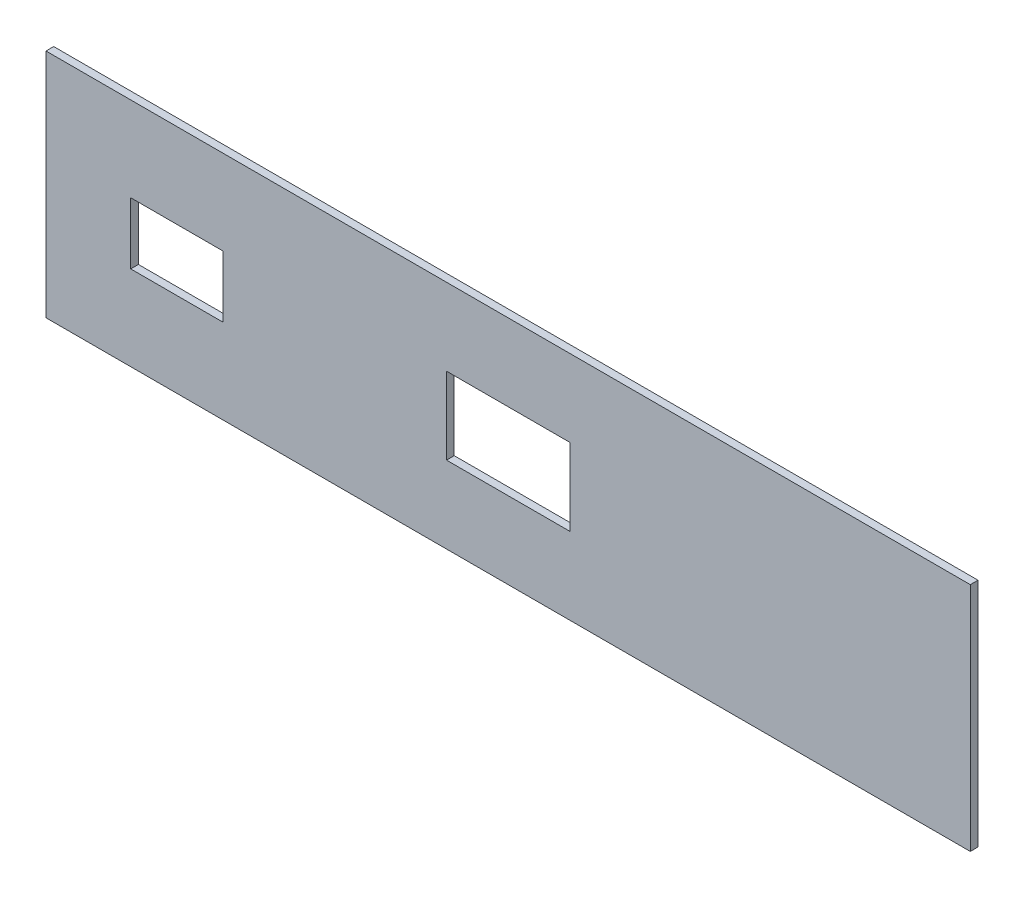
ISO-10303-21;
HEADER;
FILE_DESCRIPTION(('STEP AP214'),'2;1');
FILE_NAME('part.step','',(''),(''),'','','');
FILE_SCHEMA(('AUTOMOTIVE_DESIGN { 1 0 10303 214 1 1 1 1 }'));
ENDSEC;
DATA;
#1=APPLICATION_CONTEXT('core data for automotive mechanical design processes');
#2=APPLICATION_PROTOCOL_DEFINITION('international standard','automotive_design',2000,#1);
#3=PRODUCT_CONTEXT('',#1,'mechanical');
#4=PRODUCT('Part','Part','',(#3));
#5=PRODUCT_RELATED_PRODUCT_CATEGORY('part','',(#4));
#6=PRODUCT_DEFINITION_FORMATION('','',#4);
#7=PRODUCT_DEFINITION_CONTEXT('part definition',#1,'design');
#8=PRODUCT_DEFINITION('design','',#6,#7);
#9=PRODUCT_DEFINITION_SHAPE('','',#8);
#10=(LENGTH_UNIT() NAMED_UNIT(*) SI_UNIT(.MILLI.,.METRE.));
#11=(NAMED_UNIT(*) PLANE_ANGLE_UNIT() SI_UNIT($,.RADIAN.));
#12=(NAMED_UNIT(*) SI_UNIT($,.STERADIAN.) SOLID_ANGLE_UNIT());
#13=UNCERTAINTY_MEASURE_WITH_UNIT(LENGTH_MEASURE(1.E-05),#10,'distance_accuracy_value','');
#14=(GEOMETRIC_REPRESENTATION_CONTEXT(3) GLOBAL_UNCERTAINTY_ASSIGNED_CONTEXT((#13)) GLOBAL_UNIT_ASSIGNED_CONTEXT((#10,
#11,#12)) REPRESENTATION_CONTEXT('',''));
#15=CARTESIAN_POINT('',(0.,0.,0.));
#16=DIRECTION('',(0.,0.,1.));
#17=DIRECTION('',(1.,0.,0.));
#18=AXIS2_PLACEMENT_3D('',#15,#16,#17);
#19=CARTESIAN_POINT('',(0.,0.,5.));
#20=DIRECTION('',(0.,0.,1.));
#21=DIRECTION('',(1.,0.,0.));
#22=AXIS2_PLACEMENT_3D('',#19,#20,#21);
#23=PLANE('',#22);
#24=DIRECTION('',(0.,1.,0.));
#25=VECTOR('',#24,1.);
#26=CARTESIAN_POINT('',(300.,75.,5.));
#27=LINE('',#26,#25);
#28=CARTESIAN_POINT('',(300.,-75.,5.));
#29=VERTEX_POINT('',#28);
#30=CARTESIAN_POINT('',(300.,75.,5.));
#31=VERTEX_POINT('',#30);
#32=EDGE_CURVE('E189',#29,#31,#27,.T.);
#33=ORIENTED_EDGE('',*,*,#32,.T.);
#34=DIRECTION('',(-1.,0.,0.));
#35=VECTOR('',#34,1.);
#36=CARTESIAN_POINT('',(-300.,75.,5.));
#37=LINE('',#36,#35);
#38=CARTESIAN_POINT('',(-300.,75.,5.));
#39=VERTEX_POINT('',#38);
#40=EDGE_CURVE('E192',#31,#39,#37,.T.);
#41=ORIENTED_EDGE('',*,*,#40,.T.);
#42=DIRECTION('',(0.,-1.,0.));
#43=VECTOR('',#42,1.);
#44=CARTESIAN_POINT('',(-300.,75.,5.));
#45=LINE('',#44,#43);
#46=CARTESIAN_POINT('',(-300.,-75.,5.));
#47=VERTEX_POINT('',#46);
#48=EDGE_CURVE('E195',#39,#47,#45,.T.);
#49=ORIENTED_EDGE('',*,*,#48,.T.);
#50=DIRECTION('',(1.,0.,0.));
#51=VECTOR('',#50,1.);
#52=CARTESIAN_POINT('',(-300.,-75.,5.));
#53=LINE('',#52,#51);
#54=EDGE_CURVE('E197',#47,#29,#53,.T.);
#55=ORIENTED_EDGE('',*,*,#54,.T.);
#56=EDGE_LOOP('',(#33,#41,#49,#55));
#57=FACE_BOUND('',#56,.T.);
#58=DIRECTION('',(-1.,0.,0.));
#59=VECTOR('',#58,1.);
#60=CARTESIAN_POINT('',(-245.,20.0000000000001,5.));
#61=LINE('',#60,#59);
#62=CARTESIAN_POINT('',(-185.,20.0000000000001,5.));
#63=VERTEX_POINT('',#62);
#64=CARTESIAN_POINT('',(-245.,20.0000000000001,5.));
#65=VERTEX_POINT('',#64);
#66=EDGE_CURVE('E160',#63,#65,#61,.T.);
#67=ORIENTED_EDGE('',*,*,#66,.F.);
#68=DIRECTION('',(0.,1.,0.));
#69=VECTOR('',#68,1.);
#70=CARTESIAN_POINT('',(-185.,20.0000000000001,5.));
#71=LINE('',#70,#69);
#72=CARTESIAN_POINT('',(-185.,-19.9999999999999,5.));
#73=VERTEX_POINT('',#72);
#74=EDGE_CURVE('E158',#73,#63,#71,.T.);
#75=ORIENTED_EDGE('',*,*,#74,.F.);
#76=DIRECTION('',(1.,0.,0.));
#77=VECTOR('',#76,1.);
#78=CARTESIAN_POINT('',(-245.,-19.9999999999999,5.));
#79=LINE('',#78,#77);
#80=CARTESIAN_POINT('',(-245.,-19.9999999999999,5.));
#81=VERTEX_POINT('',#80);
#82=EDGE_CURVE('E166',#81,#73,#79,.T.);
#83=ORIENTED_EDGE('',*,*,#82,.F.);
#84=DIRECTION('',(0.,-1.,0.));
#85=VECTOR('',#84,1.);
#86=CARTESIAN_POINT('',(-245.,20.0000000000001,5.));
#87=LINE('',#86,#85);
#88=EDGE_CURVE('E163',#65,#81,#87,.T.);
#89=ORIENTED_EDGE('',*,*,#88,.F.);
#90=EDGE_LOOP('',(#67,#75,#83,#89));
#91=FACE_BOUND('',#90,.T.);
#92=DIRECTION('',(-1.,0.,0.));
#93=VECTOR('',#92,1.);
#94=CARTESIAN_POINT('',(-40.,25.0000000000001,5.));
#95=LINE('',#94,#93);
#96=CARTESIAN_POINT('',(40.,25.0000000000001,5.));
#97=VERTEX_POINT('',#96);
#98=CARTESIAN_POINT('',(-40.,25.0000000000001,5.));
#99=VERTEX_POINT('',#98);
#100=EDGE_CURVE('E130',#97,#99,#95,.T.);
#101=ORIENTED_EDGE('',*,*,#100,.F.);
#102=DIRECTION('',(0.,1.,0.));
#103=VECTOR('',#102,1.);
#104=CARTESIAN_POINT('',(40.,25.0000000000001,5.));
#105=LINE('',#104,#103);
#106=CARTESIAN_POINT('',(40.,-24.9999999999999,5.));
#107=VERTEX_POINT('',#106);
#108=EDGE_CURVE('E122',#107,#97,#105,.T.);
#109=ORIENTED_EDGE('',*,*,#108,.F.);
#110=DIRECTION('',(1.,0.,0.));
#111=VECTOR('',#110,1.);
#112=CARTESIAN_POINT('',(-40.,-24.9999999999999,5.));
#113=LINE('',#112,#111);
#114=CARTESIAN_POINT('',(-40.,-24.9999999999999,5.));
#115=VERTEX_POINT('',#114);
#116=EDGE_CURVE('E144',#115,#107,#113,.T.);
#117=ORIENTED_EDGE('',*,*,#116,.F.);
#118=DIRECTION('',(0.,-1.,0.));
#119=VECTOR('',#118,1.);
#120=CARTESIAN_POINT('',(-40.,25.0000000000001,5.));
#121=LINE('',#120,#119);
#122=EDGE_CURVE('E142',#99,#115,#121,.T.);
#123=ORIENTED_EDGE('',*,*,#122,.F.);
#124=EDGE_LOOP('',(#101,#109,#117,#123));
#125=FACE_BOUND('',#124,.T.);
#126=ADVANCED_FACE('F33',(#57,#91,#125),#23,.T.);
#127=CARTESIAN_POINT('',(0.,0.,0.));
#128=DIRECTION('',(0.,0.,1.));
#129=DIRECTION('',(1.,0.,0.));
#130=AXIS2_PLACEMENT_3D('',#127,#128,#129);
#131=PLANE('',#130);
#132=DIRECTION('',(0.,1.,0.));
#133=VECTOR('',#132,1.);
#134=CARTESIAN_POINT('',(-185.,20.0000000000001,0.));
#135=LINE('',#134,#133);
#136=CARTESIAN_POINT('',(-185.,-19.9999999999999,0.));
#137=VERTEX_POINT('',#136);
#138=CARTESIAN_POINT('',(-185.,20.0000000000001,0.));
#139=VERTEX_POINT('',#138);
#140=EDGE_CURVE('E138',#137,#139,#135,.T.);
#141=ORIENTED_EDGE('',*,*,#140,.T.);
#142=DIRECTION('',(-1.,0.,0.));
#143=VECTOR('',#142,1.);
#144=CARTESIAN_POINT('',(-245.,20.0000000000001,0.));
#145=LINE('',#144,#143);
#146=CARTESIAN_POINT('',(-245.,20.0000000000001,0.));
#147=VERTEX_POINT('',#146);
#148=EDGE_CURVE('E171',#139,#147,#145,.T.);
#149=ORIENTED_EDGE('',*,*,#148,.T.);
#150=DIRECTION('',(0.,-1.,0.));
#151=VECTOR('',#150,1.);
#152=CARTESIAN_POINT('',(-245.,20.0000000000001,0.));
#153=LINE('',#152,#151);
#154=CARTESIAN_POINT('',(-245.,-19.9999999999999,0.));
#155=VERTEX_POINT('',#154);
#156=EDGE_CURVE('E174',#147,#155,#153,.T.);
#157=ORIENTED_EDGE('',*,*,#156,.T.);
#158=DIRECTION('',(1.,0.,0.));
#159=VECTOR('',#158,1.);
#160=CARTESIAN_POINT('',(-245.,-19.9999999999999,0.));
#161=LINE('',#160,#159);
#162=EDGE_CURVE('E161',#155,#137,#161,.T.);
#163=ORIENTED_EDGE('',*,*,#162,.T.);
#164=EDGE_LOOP('',(#141,#149,#157,#163));
#165=FACE_BOUND('',#164,.T.);
#166=DIRECTION('',(0.,1.,0.));
#167=VECTOR('',#166,1.);
#168=CARTESIAN_POINT('',(300.,75.,0.));
#169=LINE('',#168,#167);
#170=CARTESIAN_POINT('',(300.,-75.,0.));
#171=VERTEX_POINT('',#170);
#172=CARTESIAN_POINT('',(300.,75.,0.));
#173=VERTEX_POINT('',#172);
#174=EDGE_CURVE('E188',#171,#173,#169,.T.);
#175=ORIENTED_EDGE('',*,*,#174,.F.);
#176=DIRECTION('',(1.,0.,0.));
#177=VECTOR('',#176,1.);
#178=CARTESIAN_POINT('',(-300.,-75.,0.));
#179=LINE('',#178,#177);
#180=CARTESIAN_POINT('',(-300.,-75.,0.));
#181=VERTEX_POINT('',#180);
#182=EDGE_CURVE('E193',#181,#171,#179,.T.);
#183=ORIENTED_EDGE('',*,*,#182,.F.);
#184=DIRECTION('',(0.,-1.,0.));
#185=VECTOR('',#184,1.);
#186=CARTESIAN_POINT('',(-300.,75.,0.));
#187=LINE('',#186,#185);
#188=CARTESIAN_POINT('',(-300.,75.,0.));
#189=VERTEX_POINT('',#188);
#190=EDGE_CURVE('E204',#189,#181,#187,.T.);
#191=ORIENTED_EDGE('',*,*,#190,.F.);
#192=DIRECTION('',(-1.,0.,0.));
#193=VECTOR('',#192,1.);
#194=CARTESIAN_POINT('',(-300.,75.,0.));
#195=LINE('',#194,#193);
#196=EDGE_CURVE('E202',#173,#189,#195,.T.);
#197=ORIENTED_EDGE('',*,*,#196,.F.);
#198=EDGE_LOOP('',(#175,#183,#191,#197));
#199=FACE_BOUND('',#198,.T.);
#200=DIRECTION('',(0.,1.,0.));
#201=VECTOR('',#200,1.);
#202=CARTESIAN_POINT('',(40.,25.0000000000001,0.));
#203=LINE('',#202,#201);
#204=CARTESIAN_POINT('',(40.,-24.9999999999999,0.));
#205=VERTEX_POINT('',#204);
#206=CARTESIAN_POINT('',(40.,25.0000000000001,0.));
#207=VERTEX_POINT('',#206);
#208=EDGE_CURVE('E56',#205,#207,#203,.T.);
#209=ORIENTED_EDGE('',*,*,#208,.T.);
#210=DIRECTION('',(-1.,0.,0.));
#211=VECTOR('',#210,1.);
#212=CARTESIAN_POINT('',(-40.,25.0000000000001,0.));
#213=LINE('',#212,#211);
#214=CARTESIAN_POINT('',(-40.,25.0000000000001,0.));
#215=VERTEX_POINT('',#214);
#216=EDGE_CURVE('E137',#207,#215,#213,.T.);
#217=ORIENTED_EDGE('',*,*,#216,.T.);
#218=DIRECTION('',(0.,-1.,0.));
#219=VECTOR('',#218,1.);
#220=CARTESIAN_POINT('',(-40.,25.0000000000001,0.));
#221=LINE('',#220,#219);
#222=CARTESIAN_POINT('',(-40.,-24.9999999999999,0.));
#223=VERTEX_POINT('',#222);
#224=EDGE_CURVE('E150',#215,#223,#221,.T.);
#225=ORIENTED_EDGE('',*,*,#224,.T.);
#226=DIRECTION('',(1.,0.,0.));
#227=VECTOR('',#226,1.);
#228=CARTESIAN_POINT('',(-40.,-24.9999999999999,0.));
#229=LINE('',#228,#227);
#230=EDGE_CURVE('E131',#223,#205,#229,.T.);
#231=ORIENTED_EDGE('',*,*,#230,.T.);
#232=EDGE_LOOP('',(#209,#217,#225,#231));
#233=FACE_BOUND('',#232,.T.);
#234=ADVANCED_FACE('F222',(#165,#199,#233),#131,.F.);
#235=CARTESIAN_POINT('',(300.,75.,5.));
#236=DIRECTION('',(-1.,0.,0.));
#237=DIRECTION('',(0.,0.,1.));
#238=AXIS2_PLACEMENT_3D('',#235,#236,#237);
#239=PLANE('',#238);
#240=ORIENTED_EDGE('',*,*,#174,.T.);
#241=DIRECTION('',(0.,0.,-1.));
#242=VECTOR('',#241,1.);
#243=CARTESIAN_POINT('',(300.,75.,5.));
#244=LINE('',#243,#242);
#245=EDGE_CURVE('E11',#31,#173,#244,.T.);
#246=ORIENTED_EDGE('',*,*,#245,.F.);
#247=ORIENTED_EDGE('',*,*,#32,.F.);
#248=DIRECTION('',(0.,0.,-1.));
#249=VECTOR('',#248,1.);
#250=CARTESIAN_POINT('',(300.,-75.,5.));
#251=LINE('',#250,#249);
#252=EDGE_CURVE('E199',#29,#171,#251,.T.);
#253=ORIENTED_EDGE('',*,*,#252,.T.);
#254=EDGE_LOOP('',(#240,#246,#247,#253));
#255=FACE_BOUND('',#254,.T.);
#256=ADVANCED_FACE('F35',(#255),#239,.F.);
#257=CARTESIAN_POINT('',(-300.,75.,5.));
#258=DIRECTION('',(0.,-1.,0.));
#259=DIRECTION('',(0.,0.,-1.));
#260=AXIS2_PLACEMENT_3D('',#257,#258,#259);
#261=PLANE('',#260);
#262=ORIENTED_EDGE('',*,*,#196,.T.);
#263=DIRECTION('',(0.,0.,-1.));
#264=VECTOR('',#263,1.);
#265=CARTESIAN_POINT('',(-300.,75.,5.));
#266=LINE('',#265,#264);
#267=EDGE_CURVE('E41',#39,#189,#266,.T.);
#268=ORIENTED_EDGE('',*,*,#267,.F.);
#269=ORIENTED_EDGE('',*,*,#40,.F.);
#270=ORIENTED_EDGE('',*,*,#245,.T.);
#271=EDGE_LOOP('',(#262,#268,#269,#270));
#272=FACE_BOUND('',#271,.T.);
#273=ADVANCED_FACE('F233',(#272),#261,.F.);
#274=CARTESIAN_POINT('',(-300.,75.,5.));
#275=DIRECTION('',(1.,0.,0.));
#276=DIRECTION('',(0.,0.,-1.));
#277=AXIS2_PLACEMENT_3D('',#274,#275,#276);
#278=PLANE('',#277);
#279=ORIENTED_EDGE('',*,*,#190,.T.);
#280=DIRECTION('',(0.,0.,-1.));
#281=VECTOR('',#280,1.);
#282=CARTESIAN_POINT('',(-300.,-75.,5.));
#283=LINE('',#282,#281);
#284=EDGE_CURVE('E209',#47,#181,#283,.T.);
#285=ORIENTED_EDGE('',*,*,#284,.F.);
#286=ORIENTED_EDGE('',*,*,#48,.F.);
#287=ORIENTED_EDGE('',*,*,#267,.T.);
#288=EDGE_LOOP('',(#279,#285,#286,#287));
#289=FACE_BOUND('',#288,.T.);
#290=ADVANCED_FACE('F216',(#289),#278,.F.);
#291=CARTESIAN_POINT('',(-300.,-75.,5.));
#292=DIRECTION('',(0.,1.,0.));
#293=DIRECTION('',(0.,0.,1.));
#294=AXIS2_PLACEMENT_3D('',#291,#292,#293);
#295=PLANE('',#294);
#296=ORIENTED_EDGE('',*,*,#182,.T.);
#297=ORIENTED_EDGE('',*,*,#252,.F.);
#298=ORIENTED_EDGE('',*,*,#54,.F.);
#299=ORIENTED_EDGE('',*,*,#284,.T.);
#300=EDGE_LOOP('',(#296,#297,#298,#299));
#301=FACE_BOUND('',#300,.T.);
#302=ADVANCED_FACE('F226',(#301),#295,.F.);
#303=CARTESIAN_POINT('',(-185.,20.0000000000001,5.));
#304=DIRECTION('',(-1.,0.,0.));
#305=DIRECTION('',(0.,0.,1.));
#306=AXIS2_PLACEMENT_3D('',#303,#304,#305);
#307=PLANE('',#306);
#308=ORIENTED_EDGE('',*,*,#140,.F.);
#309=DIRECTION('',(0.,0.,-1.));
#310=VECTOR('',#309,1.);
#311=CARTESIAN_POINT('',(-185.,-19.9999999999999,5.));
#312=LINE('',#311,#310);
#313=EDGE_CURVE('E168',#73,#137,#312,.T.);
#314=ORIENTED_EDGE('',*,*,#313,.F.);
#315=ORIENTED_EDGE('',*,*,#74,.T.);
#316=DIRECTION('',(0.,0.,-1.));
#317=VECTOR('',#316,1.);
#318=CARTESIAN_POINT('',(-185.,20.0000000000001,5.));
#319=LINE('',#318,#317);
#320=EDGE_CURVE('E185',#63,#139,#319,.T.);
#321=ORIENTED_EDGE('',*,*,#320,.T.);
#322=EDGE_LOOP('',(#308,#314,#315,#321));
#323=FACE_BOUND('',#322,.T.);
#324=ADVANCED_FACE('F248',(#323),#307,.T.);
#325=CARTESIAN_POINT('',(-245.,20.0000000000001,5.));
#326=DIRECTION('',(0.,-1.,0.));
#327=DIRECTION('',(0.,0.,-1.));
#328=AXIS2_PLACEMENT_3D('',#325,#326,#327);
#329=PLANE('',#328);
#330=ORIENTED_EDGE('',*,*,#148,.F.);
#331=ORIENTED_EDGE('',*,*,#320,.F.);
#332=ORIENTED_EDGE('',*,*,#66,.T.);
#333=DIRECTION('',(0.,0.,-1.));
#334=VECTOR('',#333,1.);
#335=CARTESIAN_POINT('',(-245.,20.0000000000001,5.));
#336=LINE('',#335,#334);
#337=EDGE_CURVE('E183',#65,#147,#336,.T.);
#338=ORIENTED_EDGE('',*,*,#337,.T.);
#339=EDGE_LOOP('',(#330,#331,#332,#338));
#340=FACE_BOUND('',#339,.T.);
#341=ADVANCED_FACE('F255',(#340),#329,.T.);
#342=CARTESIAN_POINT('',(-245.,20.0000000000001,5.));
#343=DIRECTION('',(1.,0.,0.));
#344=DIRECTION('',(0.,0.,-1.));
#345=AXIS2_PLACEMENT_3D('',#342,#343,#344);
#346=PLANE('',#345);
#347=ORIENTED_EDGE('',*,*,#156,.F.);
#348=ORIENTED_EDGE('',*,*,#337,.F.);
#349=ORIENTED_EDGE('',*,*,#88,.T.);
#350=DIRECTION('',(0.,0.,-1.));
#351=VECTOR('',#350,1.);
#352=CARTESIAN_POINT('',(-245.,-19.9999999999999,5.));
#353=LINE('',#352,#351);
#354=EDGE_CURVE('E181',#81,#155,#353,.T.);
#355=ORIENTED_EDGE('',*,*,#354,.T.);
#356=EDGE_LOOP('',(#347,#348,#349,#355));
#357=FACE_BOUND('',#356,.T.);
#358=ADVANCED_FACE('F260',(#357),#346,.T.);
#359=CARTESIAN_POINT('',(-245.,-19.9999999999999,5.));
#360=DIRECTION('',(0.,1.,0.));
#361=DIRECTION('',(0.,0.,1.));
#362=AXIS2_PLACEMENT_3D('',#359,#360,#361);
#363=PLANE('',#362);
#364=ORIENTED_EDGE('',*,*,#162,.F.);
#365=ORIENTED_EDGE('',*,*,#354,.F.);
#366=ORIENTED_EDGE('',*,*,#82,.T.);
#367=ORIENTED_EDGE('',*,*,#313,.T.);
#368=EDGE_LOOP('',(#364,#365,#366,#367));
#369=FACE_BOUND('',#368,.T.);
#370=ADVANCED_FACE('F267',(#369),#363,.T.);
#371=CARTESIAN_POINT('',(40.,25.0000000000001,5.));
#372=DIRECTION('',(-1.,0.,0.));
#373=DIRECTION('',(0.,0.,1.));
#374=AXIS2_PLACEMENT_3D('',#371,#372,#373);
#375=PLANE('',#374);
#376=ORIENTED_EDGE('',*,*,#208,.F.);
#377=DIRECTION('',(0.,0.,-1.));
#378=VECTOR('',#377,1.);
#379=CARTESIAN_POINT('',(40.,-24.9999999999999,5.));
#380=LINE('',#379,#378);
#381=EDGE_CURVE('E126',#107,#205,#380,.T.);
#382=ORIENTED_EDGE('',*,*,#381,.F.);
#383=ORIENTED_EDGE('',*,*,#108,.T.);
#384=DIRECTION('',(0.,0.,-1.));
#385=VECTOR('',#384,1.);
#386=CARTESIAN_POINT('',(40.,25.0000000000001,5.));
#387=LINE('',#386,#385);
#388=EDGE_CURVE('E125',#97,#207,#387,.T.);
#389=ORIENTED_EDGE('',*,*,#388,.T.);
#390=EDGE_LOOP('',(#376,#382,#383,#389));
#391=FACE_BOUND('',#390,.T.);
#392=ADVANCED_FACE('F124',(#391),#375,.T.);
#393=CARTESIAN_POINT('',(-40.,25.0000000000001,5.));
#394=DIRECTION('',(0.,-1.,0.));
#395=DIRECTION('',(0.,0.,-1.));
#396=AXIS2_PLACEMENT_3D('',#393,#394,#395);
#397=PLANE('',#396);
#398=ORIENTED_EDGE('',*,*,#216,.F.);
#399=ORIENTED_EDGE('',*,*,#388,.F.);
#400=ORIENTED_EDGE('',*,*,#100,.T.);
#401=DIRECTION('',(0.,0.,-1.));
#402=VECTOR('',#401,1.);
#403=CARTESIAN_POINT('',(-40.,25.0000000000001,5.));
#404=LINE('',#403,#402);
#405=EDGE_CURVE('E139',#99,#215,#404,.T.);
#406=ORIENTED_EDGE('',*,*,#405,.T.);
#407=EDGE_LOOP('',(#398,#399,#400,#406));
#408=FACE_BOUND('',#407,.T.);
#409=ADVANCED_FACE('F134',(#408),#397,.T.);
#410=CARTESIAN_POINT('',(-40.,25.0000000000001,5.));
#411=DIRECTION('',(1.,0.,0.));
#412=DIRECTION('',(0.,0.,-1.));
#413=AXIS2_PLACEMENT_3D('',#410,#411,#412);
#414=PLANE('',#413);
#415=ORIENTED_EDGE('',*,*,#224,.F.);
#416=ORIENTED_EDGE('',*,*,#405,.F.);
#417=ORIENTED_EDGE('',*,*,#122,.T.);
#418=DIRECTION('',(0.,0.,-1.));
#419=VECTOR('',#418,1.);
#420=CARTESIAN_POINT('',(-40.,-24.9999999999999,5.));
#421=LINE('',#420,#419);
#422=EDGE_CURVE('E48',#115,#223,#421,.T.);
#423=ORIENTED_EDGE('',*,*,#422,.T.);
#424=EDGE_LOOP('',(#415,#416,#417,#423));
#425=FACE_BOUND('',#424,.T.);
#426=ADVANCED_FACE('F285',(#425),#414,.T.);
#427=CARTESIAN_POINT('',(-40.,-24.9999999999999,5.));
#428=DIRECTION('',(0.,1.,0.));
#429=DIRECTION('',(0.,0.,1.));
#430=AXIS2_PLACEMENT_3D('',#427,#428,#429);
#431=PLANE('',#430);
#432=ORIENTED_EDGE('',*,*,#230,.F.);
#433=ORIENTED_EDGE('',*,*,#422,.F.);
#434=ORIENTED_EDGE('',*,*,#116,.T.);
#435=ORIENTED_EDGE('',*,*,#381,.T.);
#436=EDGE_LOOP('',(#432,#433,#434,#435));
#437=FACE_BOUND('',#436,.T.);
#438=ADVANCED_FACE('F288',(#437),#431,.T.);
#439=CLOSED_SHELL('',(#126,#234,#256,#273,#290,#302,#324,#341,#358,#370,#392,#409,#426,#438));
#440=MANIFOLD_SOLID_BREP('B2',#439);
#441=ADVANCED_BREP_SHAPE_REPRESENTATION('',(#18,#440),#14);
#442=SHAPE_DEFINITION_REPRESENTATION(#9,#441);
ENDSEC;
END-ISO-10303-21;
